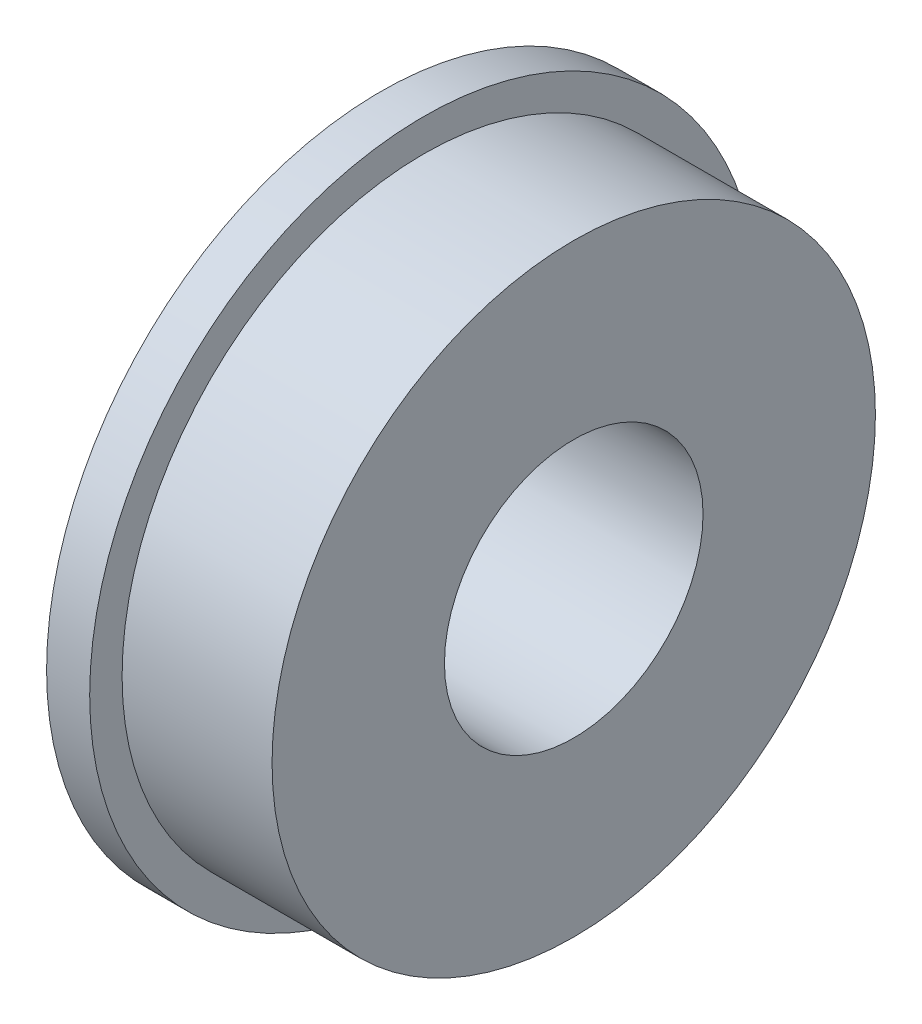
ISO-10303-21;
HEADER;
FILE_DESCRIPTION(('STEP AP214'),'2;1');
FILE_NAME('part.step','',(''),(''),'','','');
FILE_SCHEMA(('AUTOMOTIVE_DESIGN { 1 0 10303 214 1 1 1 1 }'));
ENDSEC;
DATA;
#1=APPLICATION_CONTEXT('core data for automotive mechanical design processes');
#2=APPLICATION_PROTOCOL_DEFINITION('international standard','automotive_design',2000,#1);
#3=PRODUCT_CONTEXT('',#1,'mechanical');
#4=PRODUCT('Part','Part','',(#3));
#5=PRODUCT_RELATED_PRODUCT_CATEGORY('part','',(#4));
#6=PRODUCT_DEFINITION_FORMATION('','',#4);
#7=PRODUCT_DEFINITION_CONTEXT('part definition',#1,'design');
#8=PRODUCT_DEFINITION('design','',#6,#7);
#9=PRODUCT_DEFINITION_SHAPE('','',#8);
#10=(LENGTH_UNIT() NAMED_UNIT(*) SI_UNIT(.MILLI.,.METRE.));
#11=(NAMED_UNIT(*) PLANE_ANGLE_UNIT() SI_UNIT($,.RADIAN.));
#12=(NAMED_UNIT(*) SI_UNIT($,.STERADIAN.) SOLID_ANGLE_UNIT());
#13=UNCERTAINTY_MEASURE_WITH_UNIT(LENGTH_MEASURE(1.E-05),#10,'distance_accuracy_value','');
#14=(GEOMETRIC_REPRESENTATION_CONTEXT(3) GLOBAL_UNCERTAINTY_ASSIGNED_CONTEXT((#13)) GLOBAL_UNIT_ASSIGNED_CONTEXT((#10,
#11,#12)) REPRESENTATION_CONTEXT('',''));
#15=CARTESIAN_POINT('',(0.,0.,0.));
#16=DIRECTION('',(0.,0.,1.));
#17=DIRECTION('',(1.,0.,0.));
#18=AXIS2_PLACEMENT_3D('',#15,#16,#17);
#19=CARTESIAN_POINT('',(7.112,0.,0.));
#20=DIRECTION('',(-1.,0.,0.));
#21=DIRECTION('',(0.,0.,1.));
#22=AXIS2_PLACEMENT_3D('',#19,#20,#21);
#23=CYLINDRICAL_SURFACE('',#22,6.35);
#24=CARTESIAN_POINT('',(0.381,0.,0.));
#25=DIRECTION('',(-1.,0.,0.));
#26=DIRECTION('',(0.,0.,1.));
#27=AXIS2_PLACEMENT_3D('',#24,#25,#26);
#28=CIRCLE('',#27,6.35);
#29=CARTESIAN_POINT('',(0.381,0.,6.35));
#30=VERTEX_POINT('',#29);
#31=EDGE_CURVE('E65',#30,#30,#28,.T.);
#32=ORIENTED_EDGE('',*,*,#31,.T.);
#33=EDGE_LOOP('',(#32));
#34=FACE_BOUND('',#33,.T.);
#35=CARTESIAN_POINT('',(0.,0.,0.));
#36=DIRECTION('',(-1.,0.,0.));
#37=DIRECTION('',(0.,0.,1.));
#38=AXIS2_PLACEMENT_3D('',#35,#36,#37);
#39=CIRCLE('',#38,6.35);
#40=CARTESIAN_POINT('',(0.,0.,6.35));
#41=VERTEX_POINT('',#40);
#42=EDGE_CURVE('E10',#41,#41,#39,.T.);
#43=ORIENTED_EDGE('',*,*,#42,.F.);
#44=EDGE_LOOP('',(#43));
#45=FACE_BOUND('',#44,.T.);
#46=ADVANCED_FACE('F31',(#34,#45),#23,.T.);
#47=CARTESIAN_POINT('',(0.,4.7625,0.));
#48=DIRECTION('',(-1.,0.,0.));
#49=DIRECTION('',(0.,0.,1.));
#50=AXIS2_PLACEMENT_3D('',#47,#48,#49);
#51=PLANE('',#50);
#52=ORIENTED_EDGE('',*,*,#42,.T.);
#53=EDGE_LOOP('',(#52));
#54=FACE_BOUND('',#53,.T.);
#55=CARTESIAN_POINT('',(0.,0.,0.));
#56=DIRECTION('',(-1.,0.,0.));
#57=DIRECTION('',(0.,0.,1.));
#58=AXIS2_PLACEMENT_3D('',#55,#56,#57);
#59=CIRCLE('',#58,4.7625);
#60=CARTESIAN_POINT('',(0.,0.,4.7625));
#61=VERTEX_POINT('',#60);
#62=EDGE_CURVE('E37',#61,#61,#59,.T.);
#63=ORIENTED_EDGE('',*,*,#62,.F.);
#64=EDGE_LOOP('',(#63));
#65=FACE_BOUND('',#64,.T.);
#66=ADVANCED_FACE('F83',(#54,#65),#51,.T.);
#67=CARTESIAN_POINT('',(7.112,0.,0.));
#68=DIRECTION('',(-1.,0.,0.));
#69=DIRECTION('',(0.,0.,1.));
#70=AXIS2_PLACEMENT_3D('',#67,#68,#69);
#71=CYLINDRICAL_SURFACE('',#70,4.7625);
#72=ORIENTED_EDGE('',*,*,#62,.T.);
#73=EDGE_LOOP('',(#72));
#74=FACE_BOUND('',#73,.T.);
#75=CARTESIAN_POINT('',(7.112,0.,0.));
#76=DIRECTION('',(-1.,0.,0.));
#77=DIRECTION('',(0.,0.,1.));
#78=AXIS2_PLACEMENT_3D('',#75,#76,#77);
#79=CIRCLE('',#78,4.7625);
#80=CARTESIAN_POINT('',(7.112,0.,4.7625));
#81=VERTEX_POINT('',#80);
#82=EDGE_CURVE('E41',#81,#81,#79,.T.);
#83=ORIENTED_EDGE('',*,*,#82,.F.);
#84=EDGE_LOOP('',(#83));
#85=FACE_BOUND('',#84,.T.);
#86=ADVANCED_FACE('F87',(#74,#85),#71,.F.);
#87=CARTESIAN_POINT('',(7.112,11.1125,0.));
#88=DIRECTION('',(1.,0.,0.));
#89=DIRECTION('',(0.,0.,-1.));
#90=AXIS2_PLACEMENT_3D('',#87,#88,#89);
#91=PLANE('',#90);
#92=ORIENTED_EDGE('',*,*,#82,.T.);
#93=EDGE_LOOP('',(#92));
#94=FACE_BOUND('',#93,.T.);
#95=CARTESIAN_POINT('',(7.112,0.,0.));
#96=DIRECTION('',(-1.,0.,0.));
#97=DIRECTION('',(0.,0.,1.));
#98=AXIS2_PLACEMENT_3D('',#95,#96,#97);
#99=CIRCLE('',#98,11.1125);
#100=CARTESIAN_POINT('',(7.112,0.,11.1125));
#101=VERTEX_POINT('',#100);
#102=EDGE_CURVE('E45',#101,#101,#99,.T.);
#103=ORIENTED_EDGE('',*,*,#102,.F.);
#104=EDGE_LOOP('',(#103));
#105=FACE_BOUND('',#104,.T.);
#106=ADVANCED_FACE('F91',(#94,#105),#91,.T.);
#107=CARTESIAN_POINT('',(7.112,0.,0.));
#108=DIRECTION('',(-1.,0.,0.));
#109=DIRECTION('',(0.,0.,1.));
#110=AXIS2_PLACEMENT_3D('',#107,#108,#109);
#111=CYLINDRICAL_SURFACE('',#110,11.1125);
#112=ORIENTED_EDGE('',*,*,#102,.T.);
#113=EDGE_LOOP('',(#112));
#114=FACE_BOUND('',#113,.T.);
#115=CARTESIAN_POINT('',(1.5875,0.,0.));
#116=DIRECTION('',(-1.,0.,0.));
#117=DIRECTION('',(0.,0.,1.));
#118=AXIS2_PLACEMENT_3D('',#115,#116,#117);
#119=CIRCLE('',#118,11.1125);
#120=CARTESIAN_POINT('',(1.5875,0.,11.1125));
#121=VERTEX_POINT('',#120);
#122=EDGE_CURVE('E50',#121,#121,#119,.T.);
#123=ORIENTED_EDGE('',*,*,#122,.F.);
#124=EDGE_LOOP('',(#123));
#125=FACE_BOUND('',#124,.T.);
#126=ADVANCED_FACE('F97',(#114,#125),#111,.T.);
#127=CARTESIAN_POINT('',(1.5875,12.3063,0.));
#128=DIRECTION('',(1.,0.,0.));
#129=DIRECTION('',(0.,0.,-1.));
#130=AXIS2_PLACEMENT_3D('',#127,#128,#129);
#131=PLANE('',#130);
#132=ORIENTED_EDGE('',*,*,#122,.T.);
#133=EDGE_LOOP('',(#132));
#134=FACE_BOUND('',#133,.T.);
#135=CARTESIAN_POINT('',(1.5875,0.,0.));
#136=DIRECTION('',(-1.,0.,0.));
#137=DIRECTION('',(0.,0.,1.));
#138=AXIS2_PLACEMENT_3D('',#135,#136,#137);
#139=CIRCLE('',#138,12.3063);
#140=CARTESIAN_POINT('',(1.5875,0.,12.3063));
#141=VERTEX_POINT('',#140);
#142=EDGE_CURVE('E53',#141,#141,#139,.T.);
#143=ORIENTED_EDGE('',*,*,#142,.F.);
#144=EDGE_LOOP('',(#143));
#145=FACE_BOUND('',#144,.T.);
#146=ADVANCED_FACE('F101',(#134,#145),#131,.T.);
#147=CARTESIAN_POINT('',(7.112,0.,0.));
#148=DIRECTION('',(-1.,0.,0.));
#149=DIRECTION('',(0.,0.,1.));
#150=AXIS2_PLACEMENT_3D('',#147,#148,#149);
#151=CYLINDRICAL_SURFACE('',#150,12.3063);
#152=ORIENTED_EDGE('',*,*,#142,.T.);
#153=EDGE_LOOP('',(#152));
#154=FACE_BOUND('',#153,.T.);
#155=CARTESIAN_POINT('',(0.,0.,0.));
#156=DIRECTION('',(-1.,0.,0.));
#157=DIRECTION('',(0.,0.,1.));
#158=AXIS2_PLACEMENT_3D('',#155,#156,#157);
#159=CIRCLE('',#158,12.3063);
#160=CARTESIAN_POINT('',(0.,0.,12.3063));
#161=VERTEX_POINT('',#160);
#162=EDGE_CURVE('E56',#161,#161,#159,.T.);
#163=ORIENTED_EDGE('',*,*,#162,.F.);
#164=EDGE_LOOP('',(#163));
#165=FACE_BOUND('',#164,.T.);
#166=ADVANCED_FACE('F105',(#154,#165),#151,.T.);
#167=CARTESIAN_POINT('',(0.,9.906,0.));
#168=DIRECTION('',(-1.,0.,0.));
#169=DIRECTION('',(0.,0.,1.));
#170=AXIS2_PLACEMENT_3D('',#167,#168,#169);
#171=PLANE('',#170);
#172=ORIENTED_EDGE('',*,*,#162,.T.);
#173=EDGE_LOOP('',(#172));
#174=FACE_BOUND('',#173,.T.);
#175=CARTESIAN_POINT('',(0.,0.,0.));
#176=DIRECTION('',(-1.,0.,0.));
#177=DIRECTION('',(0.,0.,1.));
#178=AXIS2_PLACEMENT_3D('',#175,#176,#177);
#179=CIRCLE('',#178,9.906);
#180=CARTESIAN_POINT('',(0.,0.,9.906));
#181=VERTEX_POINT('',#180);
#182=EDGE_CURVE('E59',#181,#181,#179,.T.);
#183=ORIENTED_EDGE('',*,*,#182,.F.);
#184=EDGE_LOOP('',(#183));
#185=FACE_BOUND('',#184,.T.);
#186=ADVANCED_FACE('F79',(#174,#185),#171,.T.);
#187=CARTESIAN_POINT('',(7.112,0.,0.));
#188=DIRECTION('',(-1.,0.,0.));
#189=DIRECTION('',(0.,0.,1.));
#190=AXIS2_PLACEMENT_3D('',#187,#188,#189);
#191=CYLINDRICAL_SURFACE('',#190,9.906);
#192=ORIENTED_EDGE('',*,*,#182,.T.);
#193=EDGE_LOOP('',(#192));
#194=FACE_BOUND('',#193,.T.);
#195=CARTESIAN_POINT('',(0.380999999999999,0.,0.));
#196=DIRECTION('',(-1.,0.,0.));
#197=DIRECTION('',(0.,0.,1.));
#198=AXIS2_PLACEMENT_3D('',#195,#196,#197);
#199=CIRCLE('',#198,9.906);
#200=CARTESIAN_POINT('',(0.380999999999999,0.,9.906));
#201=VERTEX_POINT('',#200);
#202=EDGE_CURVE('E62',#201,#201,#199,.T.);
#203=ORIENTED_EDGE('',*,*,#202,.F.);
#204=EDGE_LOOP('',(#203));
#205=FACE_BOUND('',#204,.T.);
#206=ADVANCED_FACE('F73',(#194,#205),#191,.F.);
#207=CARTESIAN_POINT('',(0.381,6.35,0.));
#208=DIRECTION('',(-1.,0.,0.));
#209=DIRECTION('',(0.,0.,1.));
#210=AXIS2_PLACEMENT_3D('',#207,#208,#209);
#211=PLANE('',#210);
#212=ORIENTED_EDGE('',*,*,#202,.T.);
#213=EDGE_LOOP('',(#212));
#214=FACE_BOUND('',#213,.T.);
#215=ORIENTED_EDGE('',*,*,#31,.F.);
#216=EDGE_LOOP('',(#215));
#217=FACE_BOUND('',#216,.T.);
#218=ADVANCED_FACE('F71',(#214,#217),#211,.T.);
#219=CLOSED_SHELL('',(#46,#66,#86,#106,#126,#146,#166,#186,#206,#218));
#220=MANIFOLD_SOLID_BREP('B2',#219);
#221=ADVANCED_BREP_SHAPE_REPRESENTATION('',(#18,#220),#14);
#222=SHAPE_DEFINITION_REPRESENTATION(#9,#221);
ENDSEC;
END-ISO-10303-21;
